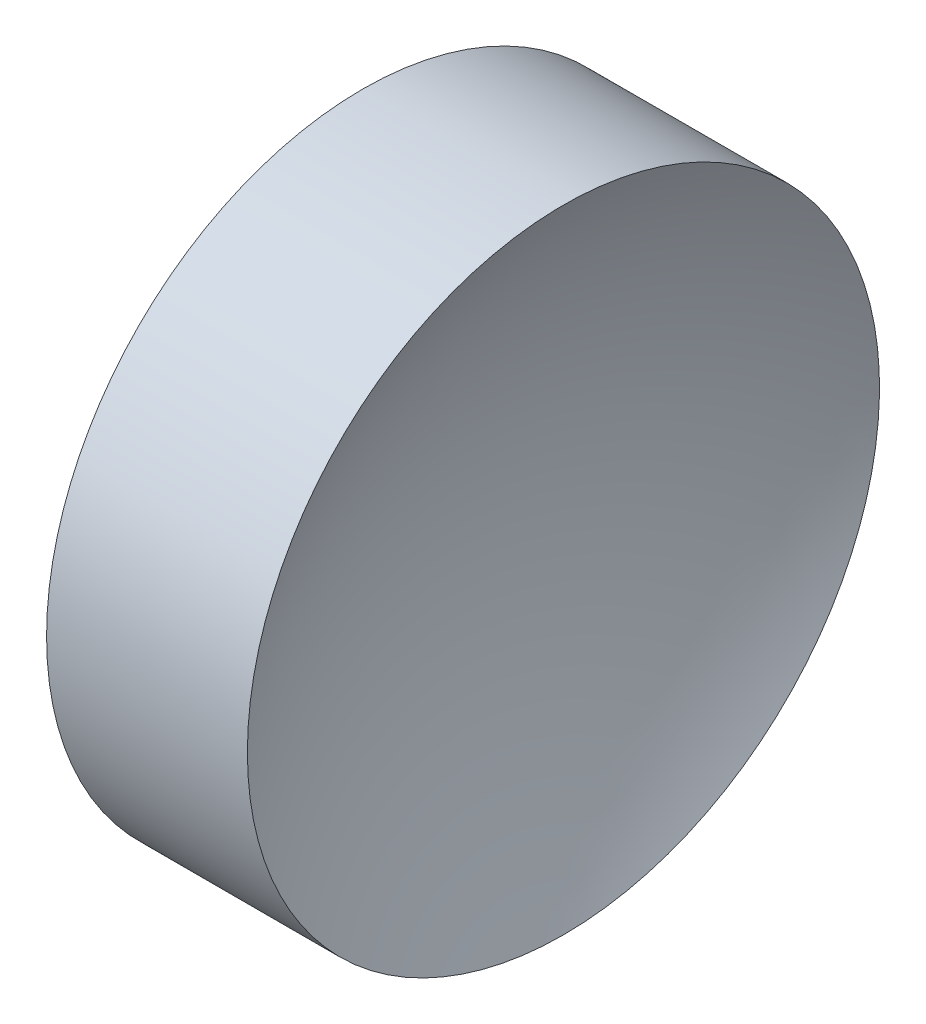
ISO-10303-21;
HEADER;
FILE_DESCRIPTION(('STEP AP214'),'2;1');
FILE_NAME('part.step','',(''),(''),'','','');
FILE_SCHEMA(('AUTOMOTIVE_DESIGN { 1 0 10303 214 1 1 1 1 }'));
ENDSEC;
DATA;
#1=APPLICATION_CONTEXT('core data for automotive mechanical design processes');
#2=APPLICATION_PROTOCOL_DEFINITION('international standard','automotive_design',2000,#1);
#3=PRODUCT_CONTEXT('',#1,'mechanical');
#4=PRODUCT('Part','Part','',(#3));
#5=PRODUCT_RELATED_PRODUCT_CATEGORY('part','',(#4));
#6=PRODUCT_DEFINITION_FORMATION('','',#4);
#7=PRODUCT_DEFINITION_CONTEXT('part definition',#1,'design');
#8=PRODUCT_DEFINITION('design','',#6,#7);
#9=PRODUCT_DEFINITION_SHAPE('','',#8);
#10=(LENGTH_UNIT() NAMED_UNIT(*) SI_UNIT(.MILLI.,.METRE.));
#11=(NAMED_UNIT(*) PLANE_ANGLE_UNIT() SI_UNIT($,.RADIAN.));
#12=(NAMED_UNIT(*) SI_UNIT($,.STERADIAN.) SOLID_ANGLE_UNIT());
#13=UNCERTAINTY_MEASURE_WITH_UNIT(LENGTH_MEASURE(1.E-05),#10,'distance_accuracy_value','');
#14=(GEOMETRIC_REPRESENTATION_CONTEXT(3) GLOBAL_UNCERTAINTY_ASSIGNED_CONTEXT((#13)) GLOBAL_UNIT_ASSIGNED_CONTEXT((#10,
#11,#12)) REPRESENTATION_CONTEXT('',''));
#15=CARTESIAN_POINT('',(0.,0.,0.));
#16=DIRECTION('',(0.,0.,1.));
#17=DIRECTION('',(1.,0.,0.));
#18=AXIS2_PLACEMENT_3D('',#15,#16,#17);
#19=CARTESIAN_POINT('',(77.1009314837368,65.2226028729874,0.));
#20=DIRECTION('',(-1.,0.,0.));
#21=DIRECTION('',(0.,1.,0.));
#22=AXIS2_PLACEMENT_3D('',#19,#20,#21);
#23=SPHERICAL_SURFACE('',#22,41.74);
#24=CARTESIAN_POINT('',(113.737355981769,65.2226028729874,0.));
#25=DIRECTION('',(-1.,0.,0.));
#26=DIRECTION('',(0.,0.,1.));
#27=AXIS2_PLACEMENT_3D('',#24,#25,#26);
#28=CIRCLE('',#27,20.);
#29=CARTESIAN_POINT('',(113.737355981769,65.2226028729874,20.));
#30=VERTEX_POINT('',#29);
#31=EDGE_CURVE('E41',#30,#30,#28,.T.);
#32=ORIENTED_EDGE('',*,*,#31,.T.);
#33=EDGE_LOOP('',(#32));
#34=FACE_BOUND('',#33,.T.);
#35=ADVANCED_FACE('F35',(#34),#23,.F.);
#36=CARTESIAN_POINT('',(163.080931483737,65.2226028729874,0.));
#37=DIRECTION('',(-1.,0.,0.));
#38=DIRECTION('',(0.,-1.,0.));
#39=AXIS2_PLACEMENT_3D('',#36,#37,#38);
#40=SPHERICAL_SURFACE('',#39,41.74);
#41=CARTESIAN_POINT('',(126.444506985705,65.2226028729874,0.));
#42=DIRECTION('',(-1.,0.,0.));
#43=DIRECTION('',(0.,0.,1.));
#44=AXIS2_PLACEMENT_3D('',#41,#42,#43);
#45=CIRCLE('',#44,20.);
#46=CARTESIAN_POINT('',(126.444506985705,65.2226028729874,20.));
#47=VERTEX_POINT('',#46);
#48=EDGE_CURVE('E10',#47,#47,#45,.T.);
#49=ORIENTED_EDGE('',*,*,#48,.F.);
#50=EDGE_LOOP('',(#49));
#51=FACE_BOUND('',#50,.T.);
#52=ADVANCED_FACE('F50',(#51),#40,.F.);
#53=CARTESIAN_POINT('',(106.124652785342,65.2226028729874,0.));
#54=DIRECTION('',(-1.,0.,0.));
#55=DIRECTION('',(0.,0.,1.));
#56=AXIS2_PLACEMENT_3D('',#53,#54,#55);
#57=CYLINDRICAL_SURFACE('',#56,20.);
#58=ORIENTED_EDGE('',*,*,#31,.F.);
#59=EDGE_LOOP('',(#58));
#60=FACE_BOUND('',#59,.T.);
#61=ORIENTED_EDGE('',*,*,#48,.T.);
#62=EDGE_LOOP('',(#61));
#63=FACE_BOUND('',#62,.T.);
#64=ADVANCED_FACE('F48',(#60,#63),#57,.T.);
#65=CLOSED_SHELL('',(#35,#52,#64));
#66=MANIFOLD_SOLID_BREP('B2',#65);
#67=ADVANCED_BREP_SHAPE_REPRESENTATION('',(#18,#66),#14);
#68=SHAPE_DEFINITION_REPRESENTATION(#9,#67);
ENDSEC;
END-ISO-10303-21;
